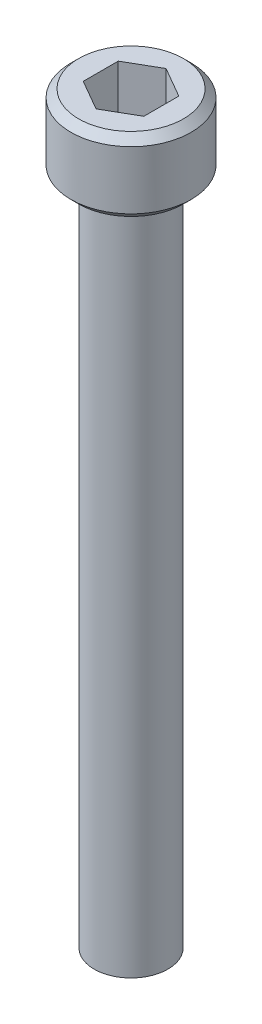
ISO-10303-21;
HEADER;
FILE_DESCRIPTION(('STEP AP214'),'2;1');
FILE_NAME('part.step','',(''),(''),'','','');
FILE_SCHEMA(('AUTOMOTIVE_DESIGN { 1 0 10303 214 1 1 1 1 }'));
ENDSEC;
DATA;
#1=APPLICATION_CONTEXT('core data for automotive mechanical design processes');
#2=APPLICATION_PROTOCOL_DEFINITION('international standard','automotive_design',2000,#1);
#3=PRODUCT_CONTEXT('',#1,'mechanical');
#4=PRODUCT('Part','Part','',(#3));
#5=PRODUCT_RELATED_PRODUCT_CATEGORY('part','',(#4));
#6=PRODUCT_DEFINITION_FORMATION('','',#4);
#7=PRODUCT_DEFINITION_CONTEXT('part definition',#1,'design');
#8=PRODUCT_DEFINITION('design','',#6,#7);
#9=PRODUCT_DEFINITION_SHAPE('','',#8);
#10=(LENGTH_UNIT() NAMED_UNIT(*) SI_UNIT(.MILLI.,.METRE.));
#11=(NAMED_UNIT(*) PLANE_ANGLE_UNIT() SI_UNIT($,.RADIAN.));
#12=(NAMED_UNIT(*) SI_UNIT($,.STERADIAN.) SOLID_ANGLE_UNIT());
#13=UNCERTAINTY_MEASURE_WITH_UNIT(LENGTH_MEASURE(1.E-05),#10,'distance_accuracy_value','');
#14=(GEOMETRIC_REPRESENTATION_CONTEXT(3) GLOBAL_UNCERTAINTY_ASSIGNED_CONTEXT((#13)) GLOBAL_UNIT_ASSIGNED_CONTEXT((#10,
#11,#12)) REPRESENTATION_CONTEXT('',''));
#15=CARTESIAN_POINT('',(0.,0.,0.));
#16=DIRECTION('',(0.,0.,1.));
#17=DIRECTION('',(1.,0.,0.));
#18=AXIS2_PLACEMENT_3D('',#15,#16,#17);
#19=CARTESIAN_POINT('',(1.984375,1.8494375,3.43703832126949));
#20=DIRECTION('',(0.,1.,0.));
#21=DIRECTION('',(0.,0.,1.));
#22=AXIS2_PLACEMENT_3D('',#19,#20,#21);
#23=PLANE('',#22);
#24=DIRECTION('',(-0.866025403784439,0.,0.5));
#25=VECTOR('',#24,1.);
#26=CARTESIAN_POINT('',(0.,1.8494375,-2.29135888084633));
#27=LINE('',#26,#25);
#28=CARTESIAN_POINT('',(0.,1.8494375,-2.29135888084633));
#29=VERTEX_POINT('',#28);
#30=CARTESIAN_POINT('',(-1.984375,1.8494375,-1.14567944042316));
#31=VERTEX_POINT('',#30);
#32=EDGE_CURVE('E69',#29,#31,#27,.T.);
#33=ORIENTED_EDGE('',*,*,#32,.T.);
#34=DIRECTION('',(0.,0.,1.));
#35=VECTOR('',#34,1.);
#36=CARTESIAN_POINT('',(-1.984375,1.8494375,-1.14567944042316));
#37=LINE('',#36,#35);
#38=CARTESIAN_POINT('',(-1.984375,1.8494375,1.14567944042317));
#39=VERTEX_POINT('',#38);
#40=EDGE_CURVE('E71',#31,#39,#37,.T.);
#41=ORIENTED_EDGE('',*,*,#40,.T.);
#42=DIRECTION('',(0.866025403784439,0.,0.499999999999999));
#43=VECTOR('',#42,1.);
#44=CARTESIAN_POINT('',(-1.984375,1.8494375,1.14567944042317));
#45=LINE('',#44,#43);
#46=CARTESIAN_POINT('',(0.,1.8494375,2.29135888084633));
#47=VERTEX_POINT('',#46);
#48=EDGE_CURVE('E73',#39,#47,#45,.T.);
#49=ORIENTED_EDGE('',*,*,#48,.T.);
#50=DIRECTION('',(0.866025403784438,0.,-0.500000000000001));
#51=VECTOR('',#50,1.);
#52=CARTESIAN_POINT('',(0.,1.8494375,2.29135888084633));
#53=LINE('',#52,#51);
#54=CARTESIAN_POINT('',(1.984375,1.8494375,1.14567944042316));
#55=VERTEX_POINT('',#54);
#56=EDGE_CURVE('E128',#47,#55,#53,.T.);
#57=ORIENTED_EDGE('',*,*,#56,.T.);
#58=DIRECTION('',(0.,0.,-1.));
#59=VECTOR('',#58,1.);
#60=CARTESIAN_POINT('',(1.984375,1.8494375,1.14567944042316));
#61=LINE('',#60,#59);
#62=CARTESIAN_POINT('',(1.984375,1.8494375,-1.14567944042316));
#63=VERTEX_POINT('',#62);
#64=EDGE_CURVE('E133',#55,#63,#61,.T.);
#65=ORIENTED_EDGE('',*,*,#64,.T.);
#66=DIRECTION('',(-0.866025403784439,0.,-0.499999999999999));
#67=VECTOR('',#66,1.);
#68=CARTESIAN_POINT('',(1.984375,1.8494375,-1.14567944042316));
#69=LINE('',#68,#67);
#70=EDGE_CURVE('E137',#63,#29,#69,.T.);
#71=ORIENTED_EDGE('',*,*,#70,.T.);
#72=EDGE_LOOP('',(#33,#41,#49,#57,#65,#71));
#73=FACE_BOUND('',#72,.T.);
#74=ADVANCED_FACE('F18',(#73),#23,.T.);
#75=CARTESIAN_POINT('',(-1.984375,1.8494375,1.14567944042317));
#76=DIRECTION('',(-0.499999999999999,0.,0.866025403784439));
#77=DIRECTION('',(0.866025403784439,0.,0.499999999999999));
#78=AXIS2_PLACEMENT_3D('',#75,#76,#77);
#79=PLANE('',#78);
#80=DIRECTION('',(0.,1.,0.));
#81=VECTOR('',#80,1.);
#82=CARTESIAN_POINT('',(0.,1.8494375,2.29135888084633));
#83=LINE('',#82,#81);
#84=CARTESIAN_POINT('',(0.,4.826,2.29135888084633));
#85=VERTEX_POINT('',#84);
#86=EDGE_CURVE('E84',#85,#47,#83,.F.);
#87=ORIENTED_EDGE('',*,*,#86,.T.);
#88=ORIENTED_EDGE('',*,*,#48,.F.);
#89=DIRECTION('',(0.,1.,0.));
#90=VECTOR('',#89,1.);
#91=CARTESIAN_POINT('',(-1.984375,1.8494375,1.14567944042317));
#92=LINE('',#91,#90);
#93=CARTESIAN_POINT('',(-1.984375,4.826,1.14567944042317));
#94=VERTEX_POINT('',#93);
#95=EDGE_CURVE('E78',#39,#94,#92,.T.);
#96=ORIENTED_EDGE('',*,*,#95,.T.);
#97=DIRECTION('',(-0.866025403784439,0.,-0.499999999999999));
#98=VECTOR('',#97,1.);
#99=CARTESIAN_POINT('',(0.,4.826,2.29135888084633));
#100=LINE('',#99,#98);
#101=EDGE_CURVE('E125',#85,#94,#100,.T.);
#102=ORIENTED_EDGE('',*,*,#101,.F.);
#103=EDGE_LOOP('',(#87,#88,#96,#102));
#104=FACE_BOUND('',#103,.T.);
#105=ADVANCED_FACE('F81',(#104),#79,.F.);
#106=CARTESIAN_POINT('',(-1.984375,1.8494375,-1.14567944042316));
#107=DIRECTION('',(-1.,0.,0.));
#108=DIRECTION('',(0.,0.,1.));
#109=AXIS2_PLACEMENT_3D('',#106,#107,#108);
#110=PLANE('',#109);
#111=ORIENTED_EDGE('',*,*,#95,.F.);
#112=ORIENTED_EDGE('',*,*,#40,.F.);
#113=DIRECTION('',(0.,1.,0.));
#114=VECTOR('',#113,1.);
#115=CARTESIAN_POINT('',(-1.984375,1.8494375,-1.14567944042316));
#116=LINE('',#115,#114);
#117=CARTESIAN_POINT('',(-1.984375,4.826,-1.14567944042316));
#118=VERTEX_POINT('',#117);
#119=EDGE_CURVE('E92',#31,#118,#116,.T.);
#120=ORIENTED_EDGE('',*,*,#119,.T.);
#121=DIRECTION('',(0.,0.,1.));
#122=VECTOR('',#121,1.);
#123=CARTESIAN_POINT('',(-1.984375,4.826,0.));
#124=LINE('',#123,#122);
#125=EDGE_CURVE('E89',#94,#118,#124,.F.);
#126=ORIENTED_EDGE('',*,*,#125,.F.);
#127=EDGE_LOOP('',(#111,#112,#120,#126));
#128=FACE_BOUND('',#127,.T.);
#129=ADVANCED_FACE('F87',(#128),#110,.F.);
#130=CARTESIAN_POINT('',(0.,1.8494375,-2.29135888084633));
#131=DIRECTION('',(-0.5,0.,-0.866025403784439));
#132=DIRECTION('',(-0.866025403784439,0.,0.5));
#133=AXIS2_PLACEMENT_3D('',#130,#131,#132);
#134=PLANE('',#133);
#135=ORIENTED_EDGE('',*,*,#119,.F.);
#136=ORIENTED_EDGE('',*,*,#32,.F.);
#137=DIRECTION('',(0.,1.,0.));
#138=VECTOR('',#137,1.);
#139=CARTESIAN_POINT('',(0.,1.8494375,-2.29135888084633));
#140=LINE('',#139,#138);
#141=CARTESIAN_POINT('',(0.,4.826,-2.29135888084633));
#142=VERTEX_POINT('',#141);
#143=EDGE_CURVE('E135',#29,#142,#140,.T.);
#144=ORIENTED_EDGE('',*,*,#143,.T.);
#145=DIRECTION('',(0.866025403784438,0.,-0.5));
#146=VECTOR('',#145,1.);
#147=CARTESIAN_POINT('',(-1.984375,4.826,-1.14567944042316));
#148=LINE('',#147,#146);
#149=EDGE_CURVE('E121',#118,#142,#148,.T.);
#150=ORIENTED_EDGE('',*,*,#149,.F.);
#151=EDGE_LOOP('',(#135,#136,#144,#150));
#152=FACE_BOUND('',#151,.T.);
#153=ADVANCED_FACE('F140',(#152),#134,.F.);
#154=CARTESIAN_POINT('',(1.984375,1.8494375,-1.14567944042316));
#155=DIRECTION('',(0.499999999999999,0.,-0.866025403784439));
#156=DIRECTION('',(-0.866025403784439,0.,-0.499999999999999));
#157=AXIS2_PLACEMENT_3D('',#154,#155,#156);
#158=PLANE('',#157);
#159=ORIENTED_EDGE('',*,*,#143,.F.);
#160=ORIENTED_EDGE('',*,*,#70,.F.);
#161=DIRECTION('',(0.,1.,0.));
#162=VECTOR('',#161,1.);
#163=CARTESIAN_POINT('',(1.984375,1.8494375,-1.14567944042316));
#164=LINE('',#163,#162);
#165=CARTESIAN_POINT('',(1.984375,4.826,-1.14567944042316));
#166=VERTEX_POINT('',#165);
#167=EDGE_CURVE('E131',#63,#166,#164,.T.);
#168=ORIENTED_EDGE('',*,*,#167,.T.);
#169=DIRECTION('',(0.866025403784439,0.,0.499999999999999));
#170=VECTOR('',#169,1.);
#171=CARTESIAN_POINT('',(0.,4.826,-2.29135888084633));
#172=LINE('',#171,#170);
#173=EDGE_CURVE('E118',#142,#166,#172,.T.);
#174=ORIENTED_EDGE('',*,*,#173,.F.);
#175=EDGE_LOOP('',(#159,#160,#168,#174));
#176=FACE_BOUND('',#175,.T.);
#177=ADVANCED_FACE('F152',(#176),#158,.F.);
#178=CARTESIAN_POINT('',(1.984375,1.8494375,1.14567944042316));
#179=DIRECTION('',(1.,0.,0.));
#180=DIRECTION('',(0.,0.,-1.));
#181=AXIS2_PLACEMENT_3D('',#178,#179,#180);
#182=PLANE('',#181);
#183=ORIENTED_EDGE('',*,*,#167,.F.);
#184=ORIENTED_EDGE('',*,*,#64,.F.);
#185=DIRECTION('',(0.,1.,0.));
#186=VECTOR('',#185,1.);
#187=CARTESIAN_POINT('',(1.984375,1.8494375,1.14567944042316));
#188=LINE('',#187,#186);
#189=CARTESIAN_POINT('',(1.984375,4.826,1.14567944042316));
#190=VERTEX_POINT('',#189);
#191=EDGE_CURVE('E36',#55,#190,#188,.T.);
#192=ORIENTED_EDGE('',*,*,#191,.T.);
#193=DIRECTION('',(0.,0.,1.));
#194=VECTOR('',#193,1.);
#195=CARTESIAN_POINT('',(1.984375,4.826,0.));
#196=LINE('',#195,#194);
#197=EDGE_CURVE('E115',#166,#190,#196,.T.);
#198=ORIENTED_EDGE('',*,*,#197,.F.);
#199=EDGE_LOOP('',(#183,#184,#192,#198));
#200=FACE_BOUND('',#199,.T.);
#201=ADVANCED_FACE('F150',(#200),#182,.F.);
#202=CARTESIAN_POINT('',(0.,1.8494375,2.29135888084633));
#203=DIRECTION('',(0.500000000000001,0.,0.866025403784438));
#204=DIRECTION('',(0.866025403784438,0.,-0.500000000000001));
#205=AXIS2_PLACEMENT_3D('',#202,#203,#204);
#206=PLANE('',#205);
#207=ORIENTED_EDGE('',*,*,#191,.F.);
#208=ORIENTED_EDGE('',*,*,#56,.F.);
#209=ORIENTED_EDGE('',*,*,#86,.F.);
#210=DIRECTION('',(-0.866025403784438,0.,0.500000000000001));
#211=VECTOR('',#210,1.);
#212=CARTESIAN_POINT('',(1.984375,4.826,1.14567944042316));
#213=LINE('',#212,#211);
#214=EDGE_CURVE('E112',#190,#85,#213,.T.);
#215=ORIENTED_EDGE('',*,*,#214,.F.);
#216=EDGE_LOOP('',(#207,#208,#209,#215));
#217=FACE_BOUND('',#216,.T.);
#218=ADVANCED_FACE('F147',(#217),#206,.F.);
#219=CARTESIAN_POINT('',(0.,4.826,0.));
#220=DIRECTION('',(0.,1.,0.));
#221=DIRECTION('',(0.,0.,1.));
#222=AXIS2_PLACEMENT_3D('',#219,#220,#221);
#223=PLANE('',#222);
#224=ORIENTED_EDGE('',*,*,#197,.T.);
#225=ORIENTED_EDGE('',*,*,#214,.T.);
#226=ORIENTED_EDGE('',*,*,#101,.T.);
#227=ORIENTED_EDGE('',*,*,#125,.T.);
#228=ORIENTED_EDGE('',*,*,#149,.T.);
#229=ORIENTED_EDGE('',*,*,#173,.T.);
#230=EDGE_LOOP('',(#224,#225,#226,#227,#228,#229));
#231=FACE_BOUND('',#230,.T.);
#232=CARTESIAN_POINT('',(0.,4.82599999998001,0.));
#233=DIRECTION('',(0.,-1.,0.));
#234=DIRECTION('',(0.,0.,-1.));
#235=AXIS2_PLACEMENT_3D('',#232,#233,#234);
#236=CIRCLE('',#235,3.42900000003965);
#237=CARTESIAN_POINT('',(0.,4.82599999998001,-3.42900000003965));
#238=VERTEX_POINT('',#237);
#239=EDGE_CURVE('E21',#238,#238,#236,.T.);
#240=ORIENTED_EDGE('',*,*,#239,.F.);
#241=EDGE_LOOP('',(#240));
#242=FACE_BOUND('',#241,.T.);
#243=ADVANCED_FACE('F144',(#231,#242),#223,.T.);
#244=CARTESIAN_POINT('',(0.,4.31800000001203,0.));
#245=DIRECTION('',(0.,-1.,0.));
#246=DIRECTION('',(0.,0.,-1.));
#247=AXIS2_PLACEMENT_3D('',#244,#245,#246);
#248=CONICAL_SURFACE('',#247,3.93700000000763,0.785398163397448);
#249=ORIENTED_EDGE('',*,*,#239,.T.);
#250=EDGE_LOOP('',(#249));
#251=FACE_BOUND('',#250,.T.);
#252=CARTESIAN_POINT('',(0.,4.318,0.));
#253=DIRECTION('',(0.,-1.,0.));
#254=DIRECTION('',(0.,0.,-1.));
#255=AXIS2_PLACEMENT_3D('',#252,#253,#254);
#256=CIRCLE('',#255,3.937);
#257=CARTESIAN_POINT('',(0.,4.318,-3.937));
#258=VERTEX_POINT('',#257);
#259=EDGE_CURVE('E104',#258,#258,#256,.T.);
#260=ORIENTED_EDGE('',*,*,#259,.F.);
#261=EDGE_LOOP('',(#260));
#262=FACE_BOUND('',#261,.T.);
#263=ADVANCED_FACE('F189',(#251,#262),#248,.T.);
#264=CARTESIAN_POINT('',(0.,4.826,0.));
#265=DIRECTION('',(0.,-1.,0.));
#266=DIRECTION('',(0.,0.,-1.));
#267=AXIS2_PLACEMENT_3D('',#264,#265,#266);
#268=CYLINDRICAL_SURFACE('',#267,3.937);
#269=ORIENTED_EDGE('',*,*,#259,.T.);
#270=EDGE_LOOP('',(#269));
#271=FACE_BOUND('',#270,.T.);
#272=CARTESIAN_POINT('',(0.,0.508000000024822,0.));
#273=DIRECTION('',(0.,1.,0.));
#274=DIRECTION('',(0.,0.,1.));
#275=AXIS2_PLACEMENT_3D('',#272,#273,#274);
#276=CIRCLE('',#275,3.93700000000763);
#277=CARTESIAN_POINT('',(0.,0.508000000024822,3.93700000000763));
#278=VERTEX_POINT('',#277);
#279=EDGE_CURVE('E100',#278,#278,#276,.F.);
#280=ORIENTED_EDGE('',*,*,#279,.F.);
#281=EDGE_LOOP('',(#280));
#282=FACE_BOUND('',#281,.T.);
#283=ADVANCED_FACE('F185',(#271,#282),#268,.T.);
#284=CARTESIAN_POINT('',(0.,-44.45,0.));
#285=DIRECTION('',(0.,1.,0.));
#286=DIRECTION('',(0.,0.,1.));
#287=AXIS2_PLACEMENT_3D('',#284,#285,#286);
#288=PLANE('',#287);
#289=CARTESIAN_POINT('',(0.,-44.4500000000347,0.));
#290=DIRECTION('',(0.,1.,0.));
#291=DIRECTION('',(0.,0.,1.));
#292=AXIS2_PLACEMENT_3D('',#289,#290,#291);
#293=CIRCLE('',#292,1.64337999996178);
#294=CARTESIAN_POINT('',(0.,-44.4500000000347,1.64337999996178));
#295=VERTEX_POINT('',#294);
#296=EDGE_CURVE('E98',#295,#295,#293,.T.);
#297=ORIENTED_EDGE('',*,*,#296,.F.);
#298=EDGE_LOOP('',(#297));
#299=FACE_BOUND('',#298,.T.);
#300=ADVANCED_FACE('F181',(#299),#288,.F.);
#301=CARTESIAN_POINT('',(0.,0.508000000024822,0.));
#302=DIRECTION('',(0.,1.,0.));
#303=DIRECTION('',(0.,0.,1.));
#304=AXIS2_PLACEMENT_3D('',#301,#302,#303);
#305=CONICAL_SURFACE('',#304,3.93700000000763,0.785398163397448);
#306=CARTESIAN_POINT('',(0.,5.6843418860808E-11,0.));
#307=DIRECTION('',(0.,1.,0.));
#308=DIRECTION('',(0.,0.,1.));
#309=AXIS2_PLACEMENT_3D('',#306,#307,#308);
#310=CIRCLE('',#309,3.42900000003965);
#311=CARTESIAN_POINT('',(0.,5.6843418860808E-11,3.42900000003965));
#312=VERTEX_POINT('',#311);
#313=EDGE_CURVE('E96',#312,#312,#310,.T.);
#314=ORIENTED_EDGE('',*,*,#313,.T.);
#315=EDGE_LOOP('',(#314));
#316=FACE_BOUND('',#315,.T.);
#317=ORIENTED_EDGE('',*,*,#279,.T.);
#318=EDGE_LOOP('',(#317));
#319=FACE_BOUND('',#318,.T.);
#320=ADVANCED_FACE('F177',(#316,#319),#305,.T.);
#321=CARTESIAN_POINT('',(0.,-43.9115200001083,0.));
#322=DIRECTION('',(0.,1.,0.));
#323=DIRECTION('',(0.,0.,1.));
#324=AXIS2_PLACEMENT_3D('',#321,#322,#323);
#325=CONICAL_SURFACE('',#324,2.41299999987632,0.960291895422592);
#326=CARTESIAN_POINT('',(0.,-43.91152,0.));
#327=DIRECTION('',(0.,1.,0.));
#328=DIRECTION('',(0.,0.,1.));
#329=AXIS2_PLACEMENT_3D('',#326,#327,#328);
#330=CIRCLE('',#329,2.413);
#331=CARTESIAN_POINT('',(0.,-43.91152,2.413));
#332=VERTEX_POINT('',#331);
#333=EDGE_CURVE('E27',#332,#332,#330,.T.);
#334=ORIENTED_EDGE('',*,*,#333,.F.);
#335=EDGE_LOOP('',(#334));
#336=FACE_BOUND('',#335,.T.);
#337=ORIENTED_EDGE('',*,*,#296,.T.);
#338=EDGE_LOOP('',(#337));
#339=FACE_BOUND('',#338,.T.);
#340=ADVANCED_FACE('F170',(#336,#339),#325,.T.);
#341=CARTESIAN_POINT('',(0.,0.,0.));
#342=DIRECTION('',(0.,1.,0.));
#343=DIRECTION('',(0.,0.,1.));
#344=AXIS2_PLACEMENT_3D('',#341,#342,#343);
#345=PLANE('',#344);
#346=CARTESIAN_POINT('',(0.,0.,0.));
#347=DIRECTION('',(0.,1.,0.));
#348=DIRECTION('',(0.,0.,1.));
#349=AXIS2_PLACEMENT_3D('',#346,#347,#348);
#350=CIRCLE('',#349,2.413);
#351=CARTESIAN_POINT('',(0.,0.,2.413));
#352=VERTEX_POINT('',#351);
#353=EDGE_CURVE('E11',#352,#352,#350,.F.);
#354=ORIENTED_EDGE('',*,*,#353,.F.);
#355=EDGE_LOOP('',(#354));
#356=FACE_BOUND('',#355,.T.);
#357=ORIENTED_EDGE('',*,*,#313,.F.);
#358=EDGE_LOOP('',(#357));
#359=FACE_BOUND('',#358,.T.);
#360=ADVANCED_FACE('F164',(#356,#359),#345,.F.);
#361=CARTESIAN_POINT('',(0.,-44.45,0.));
#362=DIRECTION('',(0.,1.,0.));
#363=DIRECTION('',(0.,0.,1.));
#364=AXIS2_PLACEMENT_3D('',#361,#362,#363);
#365=CYLINDRICAL_SURFACE('',#364,2.413);
#366=ORIENTED_EDGE('',*,*,#353,.T.);
#367=EDGE_LOOP('',(#366));
#368=FACE_BOUND('',#367,.T.);
#369=ORIENTED_EDGE('',*,*,#333,.T.);
#370=EDGE_LOOP('',(#369));
#371=FACE_BOUND('',#370,.T.);
#372=ADVANCED_FACE('F162',(#368,#371),#365,.T.);
#373=CLOSED_SHELL('',(#74,#105,#129,#153,#177,#201,#218,#243,#263,#283,#300,#320,#340,#360,#372));
#374=MANIFOLD_SOLID_BREP('B1',#373);
#375=ADVANCED_BREP_SHAPE_REPRESENTATION('',(#18,#374),#14);
#376=SHAPE_DEFINITION_REPRESENTATION(#9,#375);
ENDSEC;
END-ISO-10303-21;
